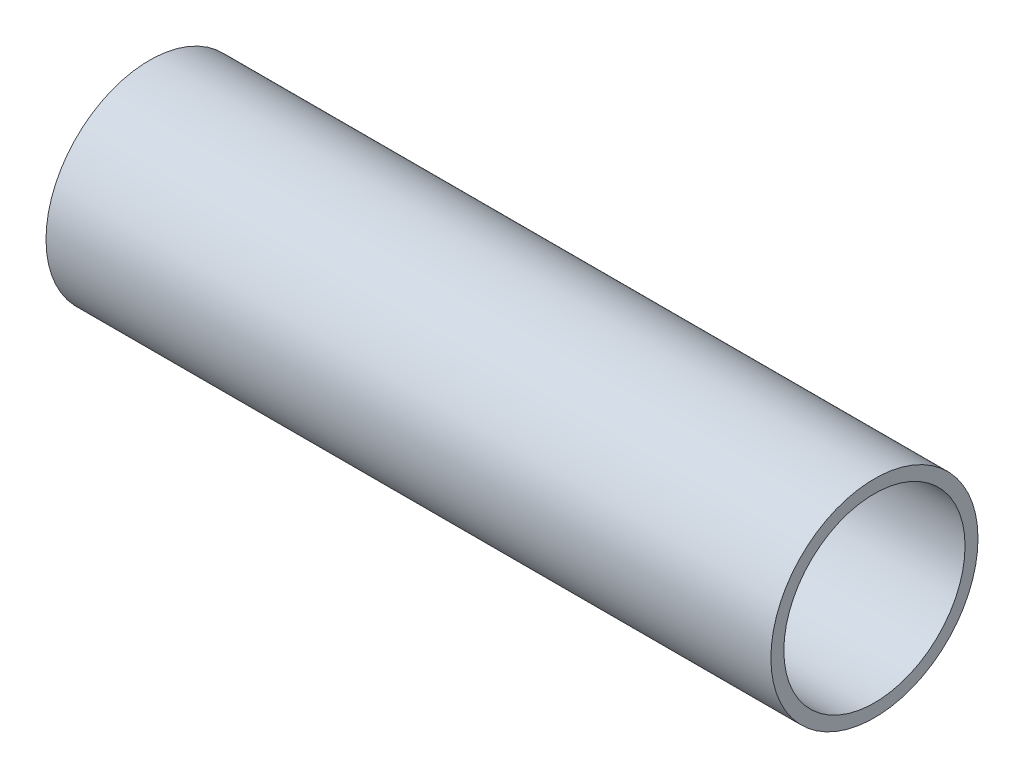
ISO-10303-21;
HEADER;
FILE_DESCRIPTION(('STEP AP214'),'2;1');
FILE_NAME('part.step','',(''),(''),'','','');
FILE_SCHEMA(('AUTOMOTIVE_DESIGN { 1 0 10303 214 1 1 1 1 }'));
ENDSEC;
DATA;
#1=APPLICATION_CONTEXT('core data for automotive mechanical design processes');
#2=APPLICATION_PROTOCOL_DEFINITION('international standard','automotive_design',2000,#1);
#3=PRODUCT_CONTEXT('',#1,'mechanical');
#4=PRODUCT('Part','Part','',(#3));
#5=PRODUCT_RELATED_PRODUCT_CATEGORY('part','',(#4));
#6=PRODUCT_DEFINITION_FORMATION('','',#4);
#7=PRODUCT_DEFINITION_CONTEXT('part definition',#1,'design');
#8=PRODUCT_DEFINITION('design','',#6,#7);
#9=PRODUCT_DEFINITION_SHAPE('','',#8);
#10=(LENGTH_UNIT() NAMED_UNIT(*) SI_UNIT(.MILLI.,.METRE.));
#11=(NAMED_UNIT(*) PLANE_ANGLE_UNIT() SI_UNIT($,.RADIAN.));
#12=(NAMED_UNIT(*) SI_UNIT($,.STERADIAN.) SOLID_ANGLE_UNIT());
#13=UNCERTAINTY_MEASURE_WITH_UNIT(LENGTH_MEASURE(1.E-05),#10,'distance_accuracy_value','');
#14=(GEOMETRIC_REPRESENTATION_CONTEXT(3) GLOBAL_UNCERTAINTY_ASSIGNED_CONTEXT((#13)) GLOBAL_UNIT_ASSIGNED_CONTEXT((#10,
#11,#12)) REPRESENTATION_CONTEXT('',''));
#15=CARTESIAN_POINT('',(0.,0.,0.));
#16=DIRECTION('',(0.,0.,1.));
#17=DIRECTION('',(1.,0.,0.));
#18=AXIS2_PLACEMENT_3D('',#15,#16,#17);
#19=CARTESIAN_POINT('',(177.8,0.,0.));
#20=DIRECTION('',(1.,0.,0.));
#21=DIRECTION('',(0.,0.,1.));
#22=AXIS2_PLACEMENT_3D('',#19,#20,#21);
#23=PLANE('',#22);
#24=CARTESIAN_POINT('',(177.8,0.,0.));
#25=DIRECTION('',(-1.,0.,0.));
#26=DIRECTION('',(0.,0.,1.));
#27=AXIS2_PLACEMENT_3D('',#24,#25,#26);
#28=CIRCLE('',#27,25.4);
#29=CARTESIAN_POINT('',(177.8,0.,25.4));
#30=VERTEX_POINT('',#29);
#31=EDGE_CURVE('E10',#30,#30,#28,.T.);
#32=ORIENTED_EDGE('',*,*,#31,.F.);
#33=EDGE_LOOP('',(#32));
#34=FACE_BOUND('',#33,.T.);
#35=CARTESIAN_POINT('',(177.8,0.,0.));
#36=DIRECTION('',(-1.,0.,0.));
#37=DIRECTION('',(0.,0.,1.));
#38=AXIS2_PLACEMENT_3D('',#35,#36,#37);
#39=CIRCLE('',#38,22.225);
#40=CARTESIAN_POINT('',(177.8,0.,22.225));
#41=VERTEX_POINT('',#40);
#42=EDGE_CURVE('E46',#41,#41,#39,.T.);
#43=ORIENTED_EDGE('',*,*,#42,.T.);
#44=EDGE_LOOP('',(#43));
#45=FACE_BOUND('',#44,.T.);
#46=ADVANCED_FACE('F35',(#34,#45),#23,.T.);
#47=CARTESIAN_POINT('',(0.,0.,0.));
#48=DIRECTION('',(1.,0.,0.));
#49=DIRECTION('',(0.,0.,1.));
#50=AXIS2_PLACEMENT_3D('',#47,#48,#49);
#51=PLANE('',#50);
#52=CARTESIAN_POINT('',(0.,0.,0.));
#53=DIRECTION('',(-1.,0.,0.));
#54=DIRECTION('',(0.,0.,1.));
#55=AXIS2_PLACEMENT_3D('',#52,#53,#54);
#56=CIRCLE('',#55,25.4);
#57=CARTESIAN_POINT('',(0.,0.,25.4));
#58=VERTEX_POINT('',#57);
#59=EDGE_CURVE('E39',#58,#58,#56,.T.);
#60=ORIENTED_EDGE('',*,*,#59,.T.);
#61=EDGE_LOOP('',(#60));
#62=FACE_BOUND('',#61,.T.);
#63=CARTESIAN_POINT('',(0.,0.,0.));
#64=DIRECTION('',(-1.,0.,0.));
#65=DIRECTION('',(0.,0.,1.));
#66=AXIS2_PLACEMENT_3D('',#63,#64,#65);
#67=CIRCLE('',#66,22.225);
#68=CARTESIAN_POINT('',(0.,0.,22.225));
#69=VERTEX_POINT('',#68);
#70=EDGE_CURVE('E48',#69,#69,#67,.T.);
#71=ORIENTED_EDGE('',*,*,#70,.F.);
#72=EDGE_LOOP('',(#71));
#73=FACE_BOUND('',#72,.T.);
#74=ADVANCED_FACE('F61',(#62,#73),#51,.F.);
#75=CARTESIAN_POINT('',(177.8,0.,0.));
#76=DIRECTION('',(-1.,0.,0.));
#77=DIRECTION('',(0.,0.,-1.));
#78=AXIS2_PLACEMENT_3D('',#75,#76,#77);
#79=CYLINDRICAL_SURFACE('',#78,25.4);
#80=ORIENTED_EDGE('',*,*,#31,.T.);
#81=EDGE_LOOP('',(#80));
#82=FACE_BOUND('',#81,.T.);
#83=ORIENTED_EDGE('',*,*,#59,.F.);
#84=EDGE_LOOP('',(#83));
#85=FACE_BOUND('',#84,.T.);
#86=ADVANCED_FACE('F37',(#82,#85),#79,.T.);
#87=CARTESIAN_POINT('',(177.8,0.,0.));
#88=DIRECTION('',(-1.,0.,0.));
#89=DIRECTION('',(0.,0.,-1.));
#90=AXIS2_PLACEMENT_3D('',#87,#88,#89);
#91=CYLINDRICAL_SURFACE('',#90,22.225);
#92=ORIENTED_EDGE('',*,*,#42,.F.);
#93=EDGE_LOOP('',(#92));
#94=FACE_BOUND('',#93,.T.);
#95=ORIENTED_EDGE('',*,*,#70,.T.);
#96=EDGE_LOOP('',(#95));
#97=FACE_BOUND('',#96,.T.);
#98=ADVANCED_FACE('F55',(#94,#97),#91,.F.);
#99=CLOSED_SHELL('',(#46,#74,#86,#98));
#100=MANIFOLD_SOLID_BREP('B2',#99);
#101=ADVANCED_BREP_SHAPE_REPRESENTATION('',(#18,#100),#14);
#102=SHAPE_DEFINITION_REPRESENTATION(#9,#101);
ENDSEC;
END-ISO-10303-21;
